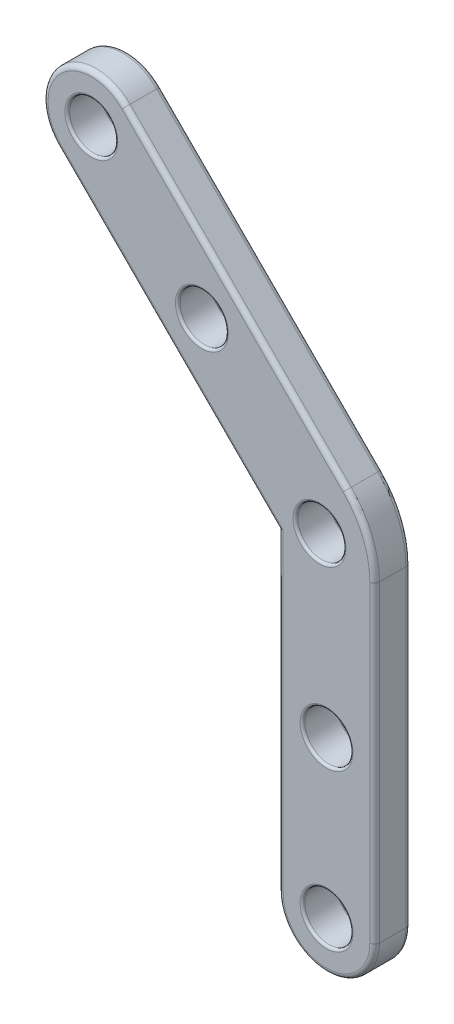
ISO-10303-21;
HEADER;
FILE_DESCRIPTION(('STEP AP214'),'2;1');
FILE_NAME('part.step','',(''),(''),'','','');
FILE_SCHEMA(('AUTOMOTIVE_DESIGN { 1 0 10303 214 1 1 1 1 }'));
ENDSEC;
DATA;
#1=APPLICATION_CONTEXT('core data for automotive mechanical design processes');
#2=APPLICATION_PROTOCOL_DEFINITION('international standard','automotive_design',2000,#1);
#3=PRODUCT_CONTEXT('',#1,'mechanical');
#4=PRODUCT('Part','Part','',(#3));
#5=PRODUCT_RELATED_PRODUCT_CATEGORY('part','',(#4));
#6=PRODUCT_DEFINITION_FORMATION('','',#4);
#7=PRODUCT_DEFINITION_CONTEXT('part definition',#1,'design');
#8=PRODUCT_DEFINITION('design','',#6,#7);
#9=PRODUCT_DEFINITION_SHAPE('','',#8);
#10=(LENGTH_UNIT() NAMED_UNIT(*) SI_UNIT(.MILLI.,.METRE.));
#11=(NAMED_UNIT(*) PLANE_ANGLE_UNIT() SI_UNIT($,.RADIAN.));
#12=(NAMED_UNIT(*) SI_UNIT($,.STERADIAN.) SOLID_ANGLE_UNIT());
#13=UNCERTAINTY_MEASURE_WITH_UNIT(LENGTH_MEASURE(1.E-05),#10,'distance_accuracy_value','');
#14=(GEOMETRIC_REPRESENTATION_CONTEXT(3) GLOBAL_UNCERTAINTY_ASSIGNED_CONTEXT((#13)) GLOBAL_UNIT_ASSIGNED_CONTEXT((#10,
#11,#12)) REPRESENTATION_CONTEXT('',''));
#15=CARTESIAN_POINT('',(0.,0.,0.));
#16=DIRECTION('',(0.,0.,1.));
#17=DIRECTION('',(1.,0.,0.));
#18=AXIS2_PLACEMENT_3D('',#15,#16,#17);
#19=CARTESIAN_POINT('',(-54.4258863696831,179.931852510646,15.));
#20=DIRECTION('',(0.,0.,-1.));
#21=DIRECTION('',(-1.,0.,0.));
#22=AXIS2_PLACEMENT_3D('',#19,#20,#21);
#23=CYLINDRICAL_SURFACE('',#22,20.);
#24=DIRECTION('',(0.,0.,-1.));
#25=VECTOR('',#24,1.);
#26=CARTESIAN_POINT('',(-68.568021993414,165.789716886915,15.));
#27=LINE('',#26,#25);
#28=CARTESIAN_POINT('',(-68.568021993414,165.789716886915,13.));
#29=VERTEX_POINT('',#28);
#30=CARTESIAN_POINT('',(-68.568021993414,165.789716886915,2.));
#31=VERTEX_POINT('',#30);
#32=EDGE_CURVE('E276',#29,#31,#27,.T.);
#33=ORIENTED_EDGE('',*,*,#32,.F.);
#34=CARTESIAN_POINT('',(-54.4258863696831,179.931852510646,13.));
#35=DIRECTION('',(0.,0.,1.));
#36=DIRECTION('',(1.,0.,0.));
#37=AXIS2_PLACEMENT_3D('',#34,#35,#36);
#38=CIRCLE('',#37,20.);
#39=CARTESIAN_POINT('',(-40.2837507459521,194.073988134377,13.));
#40=VERTEX_POINT('',#39);
#41=EDGE_CURVE('E11',#29,#40,#38,.F.);
#42=ORIENTED_EDGE('',*,*,#41,.T.);
#43=DIRECTION('',(0.,0.,-1.));
#44=VECTOR('',#43,1.);
#45=CARTESIAN_POINT('',(-40.2837507459521,194.073988134377,15.));
#46=LINE('',#45,#44);
#47=CARTESIAN_POINT('',(-40.2837507459521,194.073988134377,2.));
#48=VERTEX_POINT('',#47);
#49=EDGE_CURVE('E223',#40,#48,#46,.T.);
#50=ORIENTED_EDGE('',*,*,#49,.T.);
#51=CARTESIAN_POINT('',(-54.4258863696831,179.931852510646,2.));
#52=DIRECTION('',(0.,0.,1.));
#53=DIRECTION('',(1.,0.,0.));
#54=AXIS2_PLACEMENT_3D('',#51,#52,#53);
#55=CIRCLE('',#54,20.);
#56=EDGE_CURVE('E44',#48,#31,#55,.T.);
#57=ORIENTED_EDGE('',*,*,#56,.T.);
#58=EDGE_LOOP('',(#33,#42,#50,#57));
#59=FACE_BOUND('',#58,.T.);
#60=ADVANCED_FACE('F35',(#59),#23,.T.);
#61=CARTESIAN_POINT('',(142.953071662512,-45.7313767690108,15.));
#62=DIRECTION('',(-0.707106781186547,-0.707106781186548,0.));
#63=DIRECTION('',(0.707106781186548,-0.707106781186547,0.));
#64=AXIS2_PLACEMENT_3D('',#61,#62,#63);
#65=PLANE('',#64);
#66=DIRECTION('',(0.,0.,-1.));
#67=VECTOR('',#66,1.);
#68=CARTESIAN_POINT('',(23.3558595608372,73.865835332664,15.));
#69=LINE('',#68,#67);
#70=CARTESIAN_POINT('',(23.3558595608372,73.865835332664,13.));
#71=VERTEX_POINT('',#70);
#72=CARTESIAN_POINT('',(23.3558595608372,73.865835332664,2.));
#73=VERTEX_POINT('',#72);
#74=EDGE_CURVE('E268',#71,#73,#69,.T.);
#75=ORIENTED_EDGE('',*,*,#74,.F.);
#76=DIRECTION('',(-0.707106781186548,0.707106781186547,0.));
#77=VECTOR('',#76,1.);
#78=CARTESIAN_POINT('',(142.953071662512,-45.7313767690108,13.));
#79=LINE('',#78,#77);
#80=EDGE_CURVE('E58',#71,#29,#79,.T.);
#81=ORIENTED_EDGE('',*,*,#80,.T.);
#82=ORIENTED_EDGE('',*,*,#32,.T.);
#83=DIRECTION('',(-0.707106781186548,0.707106781186547,0.));
#84=VECTOR('',#83,1.);
#85=CARTESIAN_POINT('',(23.3558595608372,73.865835332664,2.));
#86=LINE('',#85,#84);
#87=EDGE_CURVE('E205',#31,#73,#86,.F.);
#88=ORIENTED_EDGE('',*,*,#87,.T.);
#89=EDGE_LOOP('',(#75,#81,#82,#88));
#90=FACE_BOUND('',#89,.T.);
#91=ADVANCED_FACE('F373',(#90),#65,.T.);
#92=CARTESIAN_POINT('',(23.3558595608372,-176.03531358384,15.));
#93=DIRECTION('',(1.,0.,0.));
#94=DIRECTION('',(0.,1.,0.));
#95=AXIS2_PLACEMENT_3D('',#92,#93,#94);
#96=PLANE('',#95);
#97=DIRECTION('',(0.,0.,-1.));
#98=VECTOR('',#97,1.);
#99=CARTESIAN_POINT('',(23.3558595608372,-56.134164667336,15.));
#100=LINE('',#99,#98);
#101=CARTESIAN_POINT('',(23.3558595608372,-56.134164667336,13.));
#102=VERTEX_POINT('',#101);
#103=CARTESIAN_POINT('',(23.3558595608372,-56.134164667336,2.));
#104=VERTEX_POINT('',#103);
#105=EDGE_CURVE('E260',#102,#104,#100,.T.);
#106=ORIENTED_EDGE('',*,*,#105,.F.);
#107=DIRECTION('',(0.,-1.,0.));
#108=VECTOR('',#107,1.);
#109=CARTESIAN_POINT('',(23.3558595608372,73.865835332664,13.));
#110=LINE('',#109,#108);
#111=EDGE_CURVE('E203',#102,#71,#110,.F.);
#112=ORIENTED_EDGE('',*,*,#111,.T.);
#113=ORIENTED_EDGE('',*,*,#74,.T.);
#114=DIRECTION('',(0.,-1.,0.));
#115=VECTOR('',#114,1.);
#116=CARTESIAN_POINT('',(23.3558595608372,-176.03531358384,2.));
#117=LINE('',#116,#115);
#118=EDGE_CURVE('E201',#73,#104,#117,.T.);
#119=ORIENTED_EDGE('',*,*,#118,.T.);
#120=EDGE_LOOP('',(#106,#112,#113,#119));
#121=FACE_BOUND('',#120,.T.);
#122=ADVANCED_FACE('F372',(#121),#96,.F.);
#123=CARTESIAN_POINT('',(43.3558595608372,-56.134164667336,15.));
#124=DIRECTION('',(0.,0.,-1.));
#125=DIRECTION('',(-1.,0.,0.));
#126=AXIS2_PLACEMENT_3D('',#123,#124,#125);
#127=CYLINDRICAL_SURFACE('',#126,20.);
#128=DIRECTION('',(0.,0.,-1.));
#129=VECTOR('',#128,1.);
#130=CARTESIAN_POINT('',(63.3558595608372,-56.134164667336,15.));
#131=LINE('',#130,#129);
#132=CARTESIAN_POINT('',(63.3558595608372,-56.134164667336,13.));
#133=VERTEX_POINT('',#132);
#134=CARTESIAN_POINT('',(63.3558595608372,-56.134164667336,2.));
#135=VERTEX_POINT('',#134);
#136=EDGE_CURVE('E257',#133,#135,#131,.T.);
#137=ORIENTED_EDGE('',*,*,#136,.F.);
#138=CARTESIAN_POINT('',(43.3558595608372,-56.134164667336,13.));
#139=DIRECTION('',(0.,0.,1.));
#140=DIRECTION('',(1.,0.,0.));
#141=AXIS2_PLACEMENT_3D('',#138,#139,#140);
#142=CIRCLE('',#141,20.);
#143=EDGE_CURVE('E199',#133,#102,#142,.F.);
#144=ORIENTED_EDGE('',*,*,#143,.T.);
#145=ORIENTED_EDGE('',*,*,#105,.T.);
#146=CARTESIAN_POINT('',(43.3558595608372,-56.134164667336,2.));
#147=DIRECTION('',(0.,0.,1.));
#148=DIRECTION('',(1.,0.,0.));
#149=AXIS2_PLACEMENT_3D('',#146,#147,#148);
#150=CIRCLE('',#149,20.);
#151=EDGE_CURVE('E197',#104,#135,#150,.T.);
#152=ORIENTED_EDGE('',*,*,#151,.T.);
#153=EDGE_LOOP('',(#137,#144,#145,#152));
#154=FACE_BOUND('',#153,.T.);
#155=ADVANCED_FACE('F256',(#154),#127,.T.);
#156=CARTESIAN_POINT('',(63.3558595608372,-176.03531358384,15.));
#157=DIRECTION('',(1.,0.,0.));
#158=DIRECTION('',(0.,1.,0.));
#159=AXIS2_PLACEMENT_3D('',#156,#157,#158);
#160=PLANE('',#159);
#161=DIRECTION('',(0.,0.,-1.));
#162=VECTOR('',#161,1.);
#163=CARTESIAN_POINT('',(63.3558595608372,73.865835332664,15.));
#164=LINE('',#163,#162);
#165=CARTESIAN_POINT('',(63.3558595608372,73.865835332664,13.));
#166=VERTEX_POINT('',#165);
#167=CARTESIAN_POINT('',(63.3558595608372,73.865835332664,2.));
#168=VERTEX_POINT('',#167);
#169=EDGE_CURVE('E266',#166,#168,#164,.T.);
#170=ORIENTED_EDGE('',*,*,#169,.F.);
#171=DIRECTION('',(0.,-1.,0.));
#172=VECTOR('',#171,1.);
#173=CARTESIAN_POINT('',(63.3558595608372,-176.03531358384,13.));
#174=LINE('',#173,#172);
#175=EDGE_CURVE('E195',#166,#133,#174,.T.);
#176=ORIENTED_EDGE('',*,*,#175,.T.);
#177=ORIENTED_EDGE('',*,*,#136,.T.);
#178=DIRECTION('',(0.,-1.,0.));
#179=VECTOR('',#178,1.);
#180=CARTESIAN_POINT('',(63.3558595608372,73.865835332664,2.));
#181=LINE('',#180,#179);
#182=EDGE_CURVE('E193',#135,#168,#181,.F.);
#183=ORIENTED_EDGE('',*,*,#182,.T.);
#184=EDGE_LOOP('',(#170,#176,#177,#183));
#185=FACE_BOUND('',#184,.T.);
#186=ADVANCED_FACE('F263',(#185),#160,.T.);
#187=CARTESIAN_POINT('',(23.3558595608372,73.865835332664,15.));
#188=DIRECTION('',(0.,0.,-1.));
#189=DIRECTION('',(-1.,0.,0.));
#190=AXIS2_PLACEMENT_3D('',#187,#188,#189);
#191=CYLINDRICAL_SURFACE('',#190,40.);
#192=DIRECTION('',(0.,0.,-1.));
#193=VECTOR('',#192,1.);
#194=CARTESIAN_POINT('',(51.6401308082991,102.150106580126,15.));
#195=LINE('',#194,#193);
#196=CARTESIAN_POINT('',(51.6401308082991,102.150106580126,13.));
#197=VERTEX_POINT('',#196);
#198=CARTESIAN_POINT('',(51.6401308082991,102.150106580126,2.));
#199=VERTEX_POINT('',#198);
#200=EDGE_CURVE('E270',#197,#199,#195,.T.);
#201=ORIENTED_EDGE('',*,*,#200,.F.);
#202=CARTESIAN_POINT('',(23.3558595608372,73.865835332664,13.));
#203=DIRECTION('',(0.,0.,1.));
#204=DIRECTION('',(1.,0.,0.));
#205=AXIS2_PLACEMENT_3D('',#202,#203,#204);
#206=CIRCLE('',#205,40.);
#207=EDGE_CURVE('E191',#197,#166,#206,.F.);
#208=ORIENTED_EDGE('',*,*,#207,.T.);
#209=ORIENTED_EDGE('',*,*,#169,.T.);
#210=CARTESIAN_POINT('',(23.3558595608372,73.865835332664,2.));
#211=DIRECTION('',(0.,0.,1.));
#212=DIRECTION('',(1.,0.,0.));
#213=AXIS2_PLACEMENT_3D('',#210,#211,#212);
#214=CIRCLE('',#213,40.);
#215=EDGE_CURVE('E189',#168,#199,#214,.T.);
#216=ORIENTED_EDGE('',*,*,#215,.T.);
#217=EDGE_LOOP('',(#201,#208,#209,#216));
#218=FACE_BOUND('',#217,.T.);
#219=ADVANCED_FACE('F357',(#218),#191,.T.);
#220=CARTESIAN_POINT('',(171.237342909974,-17.447105521549,15.));
#221=DIRECTION('',(-0.707106781186547,-0.707106781186547,0.));
#222=DIRECTION('',(0.707106781186548,-0.707106781186548,0.));
#223=AXIS2_PLACEMENT_3D('',#220,#221,#222);
#224=PLANE('',#223);
#225=ORIENTED_EDGE('',*,*,#49,.F.);
#226=DIRECTION('',(-0.707106781186548,0.707106781186548,0.));
#227=VECTOR('',#226,1.);
#228=CARTESIAN_POINT('',(51.6401308082991,102.150106580126,13.));
#229=LINE('',#228,#227);
#230=EDGE_CURVE('E145',#40,#197,#229,.F.);
#231=ORIENTED_EDGE('',*,*,#230,.T.);
#232=ORIENTED_EDGE('',*,*,#200,.T.);
#233=DIRECTION('',(-0.707106781186548,0.707106781186548,0.));
#234=VECTOR('',#233,1.);
#235=CARTESIAN_POINT('',(171.237342909974,-17.447105521549,2.));
#236=LINE('',#235,#234);
#237=EDGE_CURVE('E165',#199,#48,#236,.T.);
#238=ORIENTED_EDGE('',*,*,#237,.T.);
#239=EDGE_LOOP('',(#225,#231,#232,#238));
#240=FACE_BOUND('',#239,.T.);
#241=ADVANCED_FACE('F355',(#240),#224,.F.);
#242=CARTESIAN_POINT('',(12.6491348476825,-176.03531358384,15.));
#243=DIRECTION('',(0.,0.,1.));
#244=DIRECTION('',(1.,0.,0.));
#245=AXIS2_PLACEMENT_3D('',#242,#243,#244);
#246=PLANE('',#245);
#247=CARTESIAN_POINT('',(23.3558595608372,73.865835332664,15.));
#248=DIRECTION('',(0.,0.,1.));
#249=DIRECTION('',(1.,0.,0.));
#250=AXIS2_PLACEMENT_3D('',#247,#248,#249);
#251=CIRCLE('',#250,38.);
#252=CARTESIAN_POINT('',(61.3558595608372,73.865835332664,15.));
#253=VERTEX_POINT('',#252);
#254=CARTESIAN_POINT('',(50.225917245926,100.735893017753,15.));
#255=VERTEX_POINT('',#254);
#256=EDGE_CURVE('E163',#253,#255,#251,.T.);
#257=ORIENTED_EDGE('',*,*,#256,.T.);
#258=DIRECTION('',(-0.707106781186548,0.707106781186548,0.));
#259=VECTOR('',#258,1.);
#260=CARTESIAN_POINT('',(-41.6979643083252,192.659774572004,15.));
#261=LINE('',#260,#259);
#262=CARTESIAN_POINT('',(-41.6979643083252,192.659774572004,15.));
#263=VERTEX_POINT('',#262);
#264=EDGE_CURVE('E143',#255,#263,#261,.T.);
#265=ORIENTED_EDGE('',*,*,#264,.T.);
#266=CARTESIAN_POINT('',(-54.4258863696831,179.931852510646,15.));
#267=DIRECTION('',(0.,0.,1.));
#268=DIRECTION('',(1.,0.,0.));
#269=AXIS2_PLACEMENT_3D('',#266,#267,#268);
#270=CIRCLE('',#269,18.);
#271=CARTESIAN_POINT('',(-67.1538084310409,167.203930449288,15.));
#272=VERTEX_POINT('',#271);
#273=EDGE_CURVE('E151',#263,#272,#270,.T.);
#274=ORIENTED_EDGE('',*,*,#273,.T.);
#275=DIRECTION('',(-0.707106781186548,0.707106781186547,0.));
#276=VECTOR('',#275,1.);
#277=CARTESIAN_POINT('',(144.367285224885,-44.3171632066377,15.));
#278=LINE('',#277,#276);
#279=CARTESIAN_POINT('',(25.3558595608372,74.6942624574101,15.));
#280=VERTEX_POINT('',#279);
#281=EDGE_CURVE('E157',#272,#280,#278,.F.);
#282=ORIENTED_EDGE('',*,*,#281,.T.);
#283=DIRECTION('',(0.,-1.,0.));
#284=VECTOR('',#283,1.);
#285=CARTESIAN_POINT('',(25.3558595608372,-56.134164667336,15.));
#286=LINE('',#285,#284);
#287=CARTESIAN_POINT('',(25.3558595608372,-56.134164667336,15.));
#288=VERTEX_POINT('',#287);
#289=EDGE_CURVE('E338',#280,#288,#286,.T.);
#290=ORIENTED_EDGE('',*,*,#289,.T.);
#291=CARTESIAN_POINT('',(43.3558595608372,-56.134164667336,15.));
#292=DIRECTION('',(0.,0.,1.));
#293=DIRECTION('',(1.,0.,0.));
#294=AXIS2_PLACEMENT_3D('',#291,#292,#293);
#295=CIRCLE('',#294,18.);
#296=CARTESIAN_POINT('',(61.3558595608372,-56.134164667336,15.));
#297=VERTEX_POINT('',#296);
#298=EDGE_CURVE('E340',#288,#297,#295,.T.);
#299=ORIENTED_EDGE('',*,*,#298,.T.);
#300=DIRECTION('',(0.,-1.,0.));
#301=VECTOR('',#300,1.);
#302=CARTESIAN_POINT('',(61.3558595608372,-176.03531358384,15.));
#303=LINE('',#302,#301);
#304=EDGE_CURVE('E169',#297,#253,#303,.F.);
#305=ORIENTED_EDGE('',*,*,#304,.T.);
#306=EDGE_LOOP('',(#257,#265,#274,#282,#290,#299,#305));
#307=FACE_BOUND('',#306,.T.);
#308=CARTESIAN_POINT('',(-54.425886369683,179.931852510646,15.));
#309=DIRECTION('',(0.,0.,1.));
#310=DIRECTION('',(1.,0.,0.));
#311=AXIS2_PLACEMENT_3D('',#308,#309,#310);
#312=CIRCLE('',#311,11.);
#313=CARTESIAN_POINT('',(-43.425886369683,179.931852510646,15.));
#314=VERTEX_POINT('',#313);
#315=EDGE_CURVE('E311',#314,#314,#312,.F.);
#316=ORIENTED_EDGE('',*,*,#315,.T.);
#317=EDGE_LOOP('',(#316));
#318=FACE_BOUND('',#317,.T.);
#319=CARTESIAN_POINT('',(-8.46394559255745,133.96991173352,15.));
#320=DIRECTION('',(0.,0.,1.));
#321=DIRECTION('',(1.,0.,0.));
#322=AXIS2_PLACEMENT_3D('',#319,#320,#321);
#323=CIRCLE('',#322,11.);
#324=CARTESIAN_POINT('',(2.53605440744255,133.96991173352,15.));
#325=VERTEX_POINT('',#324);
#326=EDGE_CURVE('E308',#325,#325,#323,.F.);
#327=ORIENTED_EDGE('',*,*,#326,.T.);
#328=EDGE_LOOP('',(#327));
#329=FACE_BOUND('',#328,.T.);
#330=CARTESIAN_POINT('',(40.4269273727027,80.9369031445294,15.));
#331=DIRECTION('',(0.,0.,1.));
#332=DIRECTION('',(1.,0.,0.));
#333=AXIS2_PLACEMENT_3D('',#330,#331,#332);
#334=CIRCLE('',#333,11.);
#335=CARTESIAN_POINT('',(51.4269273727027,80.9369031445294,15.));
#336=VERTEX_POINT('',#335);
#337=EDGE_CURVE('E305',#336,#336,#334,.F.);
#338=ORIENTED_EDGE('',*,*,#337,.T.);
#339=EDGE_LOOP('',(#338));
#340=FACE_BOUND('',#339,.T.);
#341=CARTESIAN_POINT('',(43.3558595608372,8.86583533266388,15.));
#342=DIRECTION('',(0.,0.,1.));
#343=DIRECTION('',(1.,0.,0.));
#344=AXIS2_PLACEMENT_3D('',#341,#342,#343);
#345=CIRCLE('',#344,11.);
#346=CARTESIAN_POINT('',(54.3558595608372,8.86583533266388,15.));
#347=VERTEX_POINT('',#346);
#348=EDGE_CURVE('E302',#347,#347,#345,.F.);
#349=ORIENTED_EDGE('',*,*,#348,.T.);
#350=EDGE_LOOP('',(#349));
#351=FACE_BOUND('',#350,.T.);
#352=CARTESIAN_POINT('',(43.3558595608372,-56.134164667336,15.));
#353=DIRECTION('',(0.,0.,1.));
#354=DIRECTION('',(1.,0.,0.));
#355=AXIS2_PLACEMENT_3D('',#352,#353,#354);
#356=CIRCLE('',#355,11.);
#357=CARTESIAN_POINT('',(54.3558595608372,-56.134164667336,15.));
#358=VERTEX_POINT('',#357);
#359=EDGE_CURVE('E299',#358,#358,#356,.F.);
#360=ORIENTED_EDGE('',*,*,#359,.T.);
#361=EDGE_LOOP('',(#360));
#362=FACE_BOUND('',#361,.T.);
#363=ADVANCED_FACE('F160',(#307,#318,#329,#340,#351,#362),#246,.T.);
#364=CARTESIAN_POINT('',(12.6491348476825,-176.03531358384,0.));
#365=DIRECTION('',(0.,0.,1.));
#366=DIRECTION('',(1.,0.,0.));
#367=AXIS2_PLACEMENT_3D('',#364,#365,#366);
#368=PLANE('',#367);
#369=CARTESIAN_POINT('',(-54.4258863696831,179.931852510646,0.));
#370=DIRECTION('',(0.,0.,1.));
#371=DIRECTION('',(1.,0.,0.));
#372=AXIS2_PLACEMENT_3D('',#369,#370,#371);
#373=CIRCLE('',#372,18.);
#374=CARTESIAN_POINT('',(-67.1538084310409,167.203930449288,0.));
#375=VERTEX_POINT('',#374);
#376=CARTESIAN_POINT('',(-41.6979643083252,192.659774572004,0.));
#377=VERTEX_POINT('',#376);
#378=EDGE_CURVE('E174',#375,#377,#373,.F.);
#379=ORIENTED_EDGE('',*,*,#378,.T.);
#380=DIRECTION('',(-0.707106781186548,0.707106781186548,0.));
#381=VECTOR('',#380,1.);
#382=CARTESIAN_POINT('',(169.823129347601,-18.8613190839221,0.));
#383=LINE('',#382,#381);
#384=CARTESIAN_POINT('',(50.225917245926,100.735893017753,0.));
#385=VERTEX_POINT('',#384);
#386=EDGE_CURVE('E186',#377,#385,#383,.F.);
#387=ORIENTED_EDGE('',*,*,#386,.T.);
#388=CARTESIAN_POINT('',(23.3558595608372,73.865835332664,0.));
#389=DIRECTION('',(0.,0.,1.));
#390=DIRECTION('',(1.,0.,0.));
#391=AXIS2_PLACEMENT_3D('',#388,#389,#390);
#392=CIRCLE('',#391,38.);
#393=CARTESIAN_POINT('',(61.3558595608372,73.865835332664,0.));
#394=VERTEX_POINT('',#393);
#395=EDGE_CURVE('E184',#385,#394,#392,.F.);
#396=ORIENTED_EDGE('',*,*,#395,.T.);
#397=DIRECTION('',(0.,-1.,0.));
#398=VECTOR('',#397,1.);
#399=CARTESIAN_POINT('',(61.3558595608372,-56.134164667336,0.));
#400=LINE('',#399,#398);
#401=CARTESIAN_POINT('',(61.3558595608372,-56.134164667336,0.));
#402=VERTEX_POINT('',#401);
#403=EDGE_CURVE('E182',#394,#402,#400,.T.);
#404=ORIENTED_EDGE('',*,*,#403,.T.);
#405=CARTESIAN_POINT('',(43.3558595608372,-56.134164667336,0.));
#406=DIRECTION('',(0.,0.,1.));
#407=DIRECTION('',(1.,0.,0.));
#408=AXIS2_PLACEMENT_3D('',#405,#406,#407);
#409=CIRCLE('',#408,18.);
#410=CARTESIAN_POINT('',(25.3558595608372,-56.134164667336,0.));
#411=VERTEX_POINT('',#410);
#412=EDGE_CURVE('E180',#402,#411,#409,.F.);
#413=ORIENTED_EDGE('',*,*,#412,.T.);
#414=DIRECTION('',(0.,-1.,0.));
#415=VECTOR('',#414,1.);
#416=CARTESIAN_POINT('',(25.3558595608372,-176.03531358384,0.));
#417=LINE('',#416,#415);
#418=CARTESIAN_POINT('',(25.3558595608372,74.6942624574101,0.));
#419=VERTEX_POINT('',#418);
#420=EDGE_CURVE('E178',#411,#419,#417,.F.);
#421=ORIENTED_EDGE('',*,*,#420,.T.);
#422=DIRECTION('',(-0.707106781186548,0.707106781186547,0.));
#423=VECTOR('',#422,1.);
#424=CARTESIAN_POINT('',(-67.1538084310409,167.203930449288,0.));
#425=LINE('',#424,#423);
#426=EDGE_CURVE('E176',#419,#375,#425,.T.);
#427=ORIENTED_EDGE('',*,*,#426,.T.);
#428=EDGE_LOOP('',(#379,#387,#396,#404,#413,#421,#427));
#429=FACE_BOUND('',#428,.T.);
#430=CARTESIAN_POINT('',(-54.425886369683,179.931852510646,0.));
#431=DIRECTION('',(0.,0.,1.));
#432=DIRECTION('',(1.,0.,0.));
#433=AXIS2_PLACEMENT_3D('',#430,#431,#432);
#434=CIRCLE('',#433,11.);
#435=CARTESIAN_POINT('',(-43.425886369683,179.931852510646,0.));
#436=VERTEX_POINT('',#435);
#437=EDGE_CURVE('E296',#436,#436,#434,.T.);
#438=ORIENTED_EDGE('',*,*,#437,.T.);
#439=EDGE_LOOP('',(#438));
#440=FACE_BOUND('',#439,.T.);
#441=CARTESIAN_POINT('',(-8.46394559255745,133.96991173352,0.));
#442=DIRECTION('',(0.,0.,1.));
#443=DIRECTION('',(1.,0.,0.));
#444=AXIS2_PLACEMENT_3D('',#441,#442,#443);
#445=CIRCLE('',#444,11.);
#446=CARTESIAN_POINT('',(2.53605440744255,133.96991173352,0.));
#447=VERTEX_POINT('',#446);
#448=EDGE_CURVE('E293',#447,#447,#445,.T.);
#449=ORIENTED_EDGE('',*,*,#448,.T.);
#450=EDGE_LOOP('',(#449));
#451=FACE_BOUND('',#450,.T.);
#452=CARTESIAN_POINT('',(40.4269273727027,80.9369031445294,0.));
#453=DIRECTION('',(0.,0.,1.));
#454=DIRECTION('',(1.,0.,0.));
#455=AXIS2_PLACEMENT_3D('',#452,#453,#454);
#456=CIRCLE('',#455,11.);
#457=CARTESIAN_POINT('',(51.4269273727027,80.9369031445294,0.));
#458=VERTEX_POINT('',#457);
#459=EDGE_CURVE('E290',#458,#458,#456,.T.);
#460=ORIENTED_EDGE('',*,*,#459,.T.);
#461=EDGE_LOOP('',(#460));
#462=FACE_BOUND('',#461,.T.);
#463=CARTESIAN_POINT('',(43.3558595608372,8.86583533266388,0.));
#464=DIRECTION('',(0.,0.,1.));
#465=DIRECTION('',(1.,0.,0.));
#466=AXIS2_PLACEMENT_3D('',#463,#464,#465);
#467=CIRCLE('',#466,11.);
#468=CARTESIAN_POINT('',(54.3558595608372,8.86583533266388,0.));
#469=VERTEX_POINT('',#468);
#470=EDGE_CURVE('E287',#469,#469,#467,.T.);
#471=ORIENTED_EDGE('',*,*,#470,.T.);
#472=EDGE_LOOP('',(#471));
#473=FACE_BOUND('',#472,.T.);
#474=CARTESIAN_POINT('',(43.3558595608372,-56.134164667336,0.));
#475=DIRECTION('',(0.,0.,1.));
#476=DIRECTION('',(1.,0.,0.));
#477=AXIS2_PLACEMENT_3D('',#474,#475,#476);
#478=CIRCLE('',#477,11.);
#479=CARTESIAN_POINT('',(54.3558595608372,-56.134164667336,0.));
#480=VERTEX_POINT('',#479);
#481=EDGE_CURVE('E284',#480,#480,#478,.T.);
#482=ORIENTED_EDGE('',*,*,#481,.T.);
#483=EDGE_LOOP('',(#482));
#484=FACE_BOUND('',#483,.T.);
#485=ADVANCED_FACE('F384',(#429,#440,#451,#462,#473,#484),#368,.F.);
#486=CARTESIAN_POINT('',(-54.425886369683,179.931852510646,15.));
#487=DIRECTION('',(0.,0.,-1.));
#488=DIRECTION('',(-1.,0.,0.));
#489=AXIS2_PLACEMENT_3D('',#486,#487,#488);
#490=CYLINDRICAL_SURFACE('',#489,9.99999999999999);
#491=CARTESIAN_POINT('',(-54.425886369683,179.931852510646,1.));
#492=DIRECTION('',(0.,0.,1.));
#493=DIRECTION('',(1.,0.,0.));
#494=AXIS2_PLACEMENT_3D('',#491,#492,#493);
#495=CIRCLE('',#494,9.99999999999999);
#496=CARTESIAN_POINT('',(-44.425886369683,179.931852510646,1.));
#497=VERTEX_POINT('',#496);
#498=EDGE_CURVE('E281',#497,#497,#495,.F.);
#499=ORIENTED_EDGE('',*,*,#498,.T.);
#500=EDGE_LOOP('',(#499));
#501=FACE_BOUND('',#500,.T.);
#502=CARTESIAN_POINT('',(-54.425886369683,179.931852510646,14.));
#503=DIRECTION('',(0.,0.,1.));
#504=DIRECTION('',(1.,0.,0.));
#505=AXIS2_PLACEMENT_3D('',#502,#503,#504);
#506=CIRCLE('',#505,9.99999999999999);
#507=CARTESIAN_POINT('',(-44.425886369683,179.931852510646,14.));
#508=VERTEX_POINT('',#507);
#509=EDGE_CURVE('E278',#508,#508,#506,.T.);
#510=ORIENTED_EDGE('',*,*,#509,.T.);
#511=EDGE_LOOP('',(#510));
#512=FACE_BOUND('',#511,.T.);
#513=ADVANCED_FACE('F627',(#501,#512),#490,.F.);
#514=CARTESIAN_POINT('',(-8.46394559255745,133.96991173352,15.));
#515=DIRECTION('',(0.,0.,-1.));
#516=DIRECTION('',(-1.,0.,0.));
#517=AXIS2_PLACEMENT_3D('',#514,#515,#516);
#518=CYLINDRICAL_SURFACE('',#517,10.);
#519=CARTESIAN_POINT('',(-8.46394559255745,133.96991173352,1.));
#520=DIRECTION('',(0.,0.,1.));
#521=DIRECTION('',(1.,0.,0.));
#522=AXIS2_PLACEMENT_3D('',#519,#520,#521);
#523=CIRCLE('',#522,10.);
#524=CARTESIAN_POINT('',(1.53605440744256,133.96991173352,1.));
#525=VERTEX_POINT('',#524);
#526=EDGE_CURVE('E317',#525,#525,#523,.F.);
#527=ORIENTED_EDGE('',*,*,#526,.T.);
#528=EDGE_LOOP('',(#527));
#529=FACE_BOUND('',#528,.T.);
#530=CARTESIAN_POINT('',(-8.46394559255745,133.96991173352,14.));
#531=DIRECTION('',(0.,0.,1.));
#532=DIRECTION('',(1.,0.,0.));
#533=AXIS2_PLACEMENT_3D('',#530,#531,#532);
#534=CIRCLE('',#533,10.);
#535=CARTESIAN_POINT('',(1.53605440744256,133.96991173352,14.));
#536=VERTEX_POINT('',#535);
#537=EDGE_CURVE('E314',#536,#536,#534,.T.);
#538=ORIENTED_EDGE('',*,*,#537,.T.);
#539=EDGE_LOOP('',(#538));
#540=FACE_BOUND('',#539,.T.);
#541=ADVANCED_FACE('F618',(#529,#540),#518,.F.);
#542=CARTESIAN_POINT('',(40.4269273727027,80.9369031445294,15.));
#543=DIRECTION('',(0.,0.,-1.));
#544=DIRECTION('',(-1.,0.,0.));
#545=AXIS2_PLACEMENT_3D('',#542,#543,#544);
#546=CYLINDRICAL_SURFACE('',#545,10.);
#547=CARTESIAN_POINT('',(40.4269273727027,80.9369031445294,14.));
#548=DIRECTION('',(0.,0.,1.));
#549=DIRECTION('',(1.,0.,0.));
#550=AXIS2_PLACEMENT_3D('',#547,#548,#549);
#551=CIRCLE('',#550,10.);
#552=CARTESIAN_POINT('',(50.4269273727027,80.9369031445294,14.));
#553=VERTEX_POINT('',#552);
#554=EDGE_CURVE('E323',#553,#553,#551,.T.);
#555=ORIENTED_EDGE('',*,*,#554,.T.);
#556=EDGE_LOOP('',(#555));
#557=FACE_BOUND('',#556,.T.);
#558=CARTESIAN_POINT('',(40.4269273727027,80.9369031445294,1.));
#559=DIRECTION('',(0.,0.,1.));
#560=DIRECTION('',(1.,0.,0.));
#561=AXIS2_PLACEMENT_3D('',#558,#559,#560);
#562=CIRCLE('',#561,10.);
#563=CARTESIAN_POINT('',(50.4269273727027,80.9369031445294,1.));
#564=VERTEX_POINT('',#563);
#565=EDGE_CURVE('E320',#564,#564,#562,.F.);
#566=ORIENTED_EDGE('',*,*,#565,.T.);
#567=EDGE_LOOP('',(#566));
#568=FACE_BOUND('',#567,.T.);
#569=ADVANCED_FACE('F609',(#557,#568),#546,.F.);
#570=CARTESIAN_POINT('',(43.3558595608372,8.86583533266388,15.));
#571=DIRECTION('',(0.,0.,-1.));
#572=DIRECTION('',(-1.,0.,0.));
#573=AXIS2_PLACEMENT_3D('',#570,#571,#572);
#574=CYLINDRICAL_SURFACE('',#573,10.);
#575=CARTESIAN_POINT('',(43.3558595608372,8.86583533266388,14.));
#576=DIRECTION('',(0.,0.,1.));
#577=DIRECTION('',(1.,0.,0.));
#578=AXIS2_PLACEMENT_3D('',#575,#576,#577);
#579=CIRCLE('',#578,10.);
#580=CARTESIAN_POINT('',(53.3558595608372,8.86583533266388,14.));
#581=VERTEX_POINT('',#580);
#582=EDGE_CURVE('E329',#581,#581,#579,.T.);
#583=ORIENTED_EDGE('',*,*,#582,.T.);
#584=EDGE_LOOP('',(#583));
#585=FACE_BOUND('',#584,.T.);
#586=CARTESIAN_POINT('',(43.3558595608372,8.86583533266388,1.));
#587=DIRECTION('',(0.,0.,1.));
#588=DIRECTION('',(1.,0.,0.));
#589=AXIS2_PLACEMENT_3D('',#586,#587,#588);
#590=CIRCLE('',#589,10.);
#591=CARTESIAN_POINT('',(53.3558595608372,8.86583533266388,1.));
#592=VERTEX_POINT('',#591);
#593=EDGE_CURVE('E326',#592,#592,#590,.F.);
#594=ORIENTED_EDGE('',*,*,#593,.T.);
#595=EDGE_LOOP('',(#594));
#596=FACE_BOUND('',#595,.T.);
#597=ADVANCED_FACE('F600',(#585,#596),#574,.F.);
#598=CARTESIAN_POINT('',(43.3558595608372,-56.134164667336,15.));
#599=DIRECTION('',(0.,0.,-1.));
#600=DIRECTION('',(-1.,0.,0.));
#601=AXIS2_PLACEMENT_3D('',#598,#599,#600);
#602=CYLINDRICAL_SURFACE('',#601,10.);
#603=CARTESIAN_POINT('',(43.3558595608372,-56.134164667336,14.));
#604=DIRECTION('',(0.,0.,1.));
#605=DIRECTION('',(1.,0.,0.));
#606=AXIS2_PLACEMENT_3D('',#603,#604,#605);
#607=CIRCLE('',#606,10.);
#608=CARTESIAN_POINT('',(53.3558595608372,-56.134164667336,14.));
#609=VERTEX_POINT('',#608);
#610=EDGE_CURVE('E158',#609,#609,#607,.T.);
#611=ORIENTED_EDGE('',*,*,#610,.T.);
#612=EDGE_LOOP('',(#611));
#613=FACE_BOUND('',#612,.T.);
#614=CARTESIAN_POINT('',(43.3558595608372,-56.134164667336,1.));
#615=DIRECTION('',(0.,0.,1.));
#616=DIRECTION('',(1.,0.,0.));
#617=AXIS2_PLACEMENT_3D('',#614,#615,#616);
#618=CIRCLE('',#617,10.);
#619=CARTESIAN_POINT('',(53.3558595608372,-56.134164667336,1.));
#620=VERTEX_POINT('',#619);
#621=EDGE_CURVE('E332',#620,#620,#618,.F.);
#622=ORIENTED_EDGE('',*,*,#621,.T.);
#623=EDGE_LOOP('',(#622));
#624=FACE_BOUND('',#623,.T.);
#625=ADVANCED_FACE('F413',(#613,#624),#602,.F.);
#626=CARTESIAN_POINT('',(-54.425886369683,179.931852510646,1.));
#627=DIRECTION('',(0.,0.,1.));
#628=DIRECTION('',(1.,0.,0.));
#629=AXIS2_PLACEMENT_3D('',#626,#627,#628);
#630=TOROIDAL_SURFACE('',#629,11.,1.);
#631=ORIENTED_EDGE('',*,*,#437,.F.);
#632=EDGE_LOOP('',(#631));
#633=FACE_BOUND('',#632,.T.);
#634=ORIENTED_EDGE('',*,*,#498,.F.);
#635=EDGE_LOOP('',(#634));
#636=FACE_BOUND('',#635,.T.);
#637=ADVANCED_FACE('F409',(#633,#636),#630,.T.);
#638=CARTESIAN_POINT('',(-54.425886369683,179.931852510646,14.));
#639=DIRECTION('',(0.,0.,1.));
#640=DIRECTION('',(1.,0.,0.));
#641=AXIS2_PLACEMENT_3D('',#638,#639,#640);
#642=TOROIDAL_SURFACE('',#641,11.,1.);
#643=ORIENTED_EDGE('',*,*,#509,.F.);
#644=EDGE_LOOP('',(#643));
#645=FACE_BOUND('',#644,.T.);
#646=ORIENTED_EDGE('',*,*,#315,.F.);
#647=EDGE_LOOP('',(#646));
#648=FACE_BOUND('',#647,.T.);
#649=ADVANCED_FACE('F412',(#645,#648),#642,.T.);
#650=CARTESIAN_POINT('',(-8.46394559255745,133.96991173352,1.));
#651=DIRECTION('',(0.,0.,1.));
#652=DIRECTION('',(1.,0.,0.));
#653=AXIS2_PLACEMENT_3D('',#650,#651,#652);
#654=TOROIDAL_SURFACE('',#653,11.,1.);
#655=ORIENTED_EDGE('',*,*,#448,.F.);
#656=EDGE_LOOP('',(#655));
#657=FACE_BOUND('',#656,.T.);
#658=ORIENTED_EDGE('',*,*,#526,.F.);
#659=EDGE_LOOP('',(#658));
#660=FACE_BOUND('',#659,.T.);
#661=ADVANCED_FACE('F417',(#657,#660),#654,.T.);
#662=CARTESIAN_POINT('',(-8.46394559255745,133.96991173352,14.));
#663=DIRECTION('',(0.,0.,1.));
#664=DIRECTION('',(1.,0.,0.));
#665=AXIS2_PLACEMENT_3D('',#662,#663,#664);
#666=TOROIDAL_SURFACE('',#665,11.,1.);
#667=ORIENTED_EDGE('',*,*,#537,.F.);
#668=EDGE_LOOP('',(#667));
#669=FACE_BOUND('',#668,.T.);
#670=ORIENTED_EDGE('',*,*,#326,.F.);
#671=EDGE_LOOP('',(#670));
#672=FACE_BOUND('',#671,.T.);
#673=ADVANCED_FACE('F421',(#669,#672),#666,.T.);
#674=CARTESIAN_POINT('',(40.4269273727027,80.9369031445294,14.));
#675=DIRECTION('',(0.,0.,1.));
#676=DIRECTION('',(1.,0.,0.));
#677=AXIS2_PLACEMENT_3D('',#674,#675,#676);
#678=TOROIDAL_SURFACE('',#677,11.,1.);
#679=ORIENTED_EDGE('',*,*,#554,.F.);
#680=EDGE_LOOP('',(#679));
#681=FACE_BOUND('',#680,.T.);
#682=ORIENTED_EDGE('',*,*,#337,.F.);
#683=EDGE_LOOP('',(#682));
#684=FACE_BOUND('',#683,.T.);
#685=ADVANCED_FACE('F425',(#681,#684),#678,.T.);
#686=CARTESIAN_POINT('',(40.4269273727027,80.9369031445294,1.));
#687=DIRECTION('',(0.,0.,1.));
#688=DIRECTION('',(1.,0.,0.));
#689=AXIS2_PLACEMENT_3D('',#686,#687,#688);
#690=TOROIDAL_SURFACE('',#689,11.,1.);
#691=ORIENTED_EDGE('',*,*,#459,.F.);
#692=EDGE_LOOP('',(#691));
#693=FACE_BOUND('',#692,.T.);
#694=ORIENTED_EDGE('',*,*,#565,.F.);
#695=EDGE_LOOP('',(#694));
#696=FACE_BOUND('',#695,.T.);
#697=ADVANCED_FACE('F429',(#693,#696),#690,.T.);
#698=CARTESIAN_POINT('',(43.3558595608372,8.86583533266388,14.));
#699=DIRECTION('',(0.,0.,1.));
#700=DIRECTION('',(1.,0.,0.));
#701=AXIS2_PLACEMENT_3D('',#698,#699,#700);
#702=TOROIDAL_SURFACE('',#701,11.,1.);
#703=ORIENTED_EDGE('',*,*,#582,.F.);
#704=EDGE_LOOP('',(#703));
#705=FACE_BOUND('',#704,.T.);
#706=ORIENTED_EDGE('',*,*,#348,.F.);
#707=EDGE_LOOP('',(#706));
#708=FACE_BOUND('',#707,.T.);
#709=ADVANCED_FACE('F433',(#705,#708),#702,.T.);
#710=CARTESIAN_POINT('',(43.3558595608372,8.86583533266388,1.));
#711=DIRECTION('',(0.,0.,1.));
#712=DIRECTION('',(1.,0.,0.));
#713=AXIS2_PLACEMENT_3D('',#710,#711,#712);
#714=TOROIDAL_SURFACE('',#713,11.,1.);
#715=ORIENTED_EDGE('',*,*,#470,.F.);
#716=EDGE_LOOP('',(#715));
#717=FACE_BOUND('',#716,.T.);
#718=ORIENTED_EDGE('',*,*,#593,.F.);
#719=EDGE_LOOP('',(#718));
#720=FACE_BOUND('',#719,.T.);
#721=ADVANCED_FACE('F437',(#717,#720),#714,.T.);
#722=CARTESIAN_POINT('',(43.3558595608372,-56.134164667336,14.));
#723=DIRECTION('',(0.,0.,1.));
#724=DIRECTION('',(1.,0.,0.));
#725=AXIS2_PLACEMENT_3D('',#722,#723,#724);
#726=TOROIDAL_SURFACE('',#725,11.,1.);
#727=ORIENTED_EDGE('',*,*,#610,.F.);
#728=EDGE_LOOP('',(#727));
#729=FACE_BOUND('',#728,.T.);
#730=ORIENTED_EDGE('',*,*,#359,.F.);
#731=EDGE_LOOP('',(#730));
#732=FACE_BOUND('',#731,.T.);
#733=ADVANCED_FACE('F441',(#729,#732),#726,.T.);
#734=CARTESIAN_POINT('',(43.3558595608372,-56.134164667336,1.));
#735=DIRECTION('',(0.,0.,1.));
#736=DIRECTION('',(1.,0.,0.));
#737=AXIS2_PLACEMENT_3D('',#734,#735,#736);
#738=TOROIDAL_SURFACE('',#737,11.,1.);
#739=ORIENTED_EDGE('',*,*,#481,.F.);
#740=EDGE_LOOP('',(#739));
#741=FACE_BOUND('',#740,.T.);
#742=ORIENTED_EDGE('',*,*,#621,.F.);
#743=EDGE_LOOP('',(#742));
#744=FACE_BOUND('',#743,.T.);
#745=ADVANCED_FACE('F445',(#741,#744),#738,.T.);
#746=CARTESIAN_POINT('',(43.3558595608372,-56.134164667336,13.));
#747=DIRECTION('',(0.,0.,1.));
#748=DIRECTION('',(1.,0.,0.));
#749=AXIS2_PLACEMENT_3D('',#746,#747,#748);
#750=TOROIDAL_SURFACE('',#749,18.,2.);
#751=CARTESIAN_POINT('',(61.3558595608372,-56.134164667336,13.));
#752=DIRECTION('',(0.,1.,0.));
#753=DIRECTION('',(0.,0.,1.));
#754=AXIS2_PLACEMENT_3D('',#751,#752,#753);
#755=CIRCLE('',#754,2.);
#756=EDGE_CURVE('E217',#297,#133,#755,.T.);
#757=ORIENTED_EDGE('',*,*,#756,.F.);
#758=ORIENTED_EDGE('',*,*,#298,.F.);
#759=CARTESIAN_POINT('',(25.3558595608372,-56.134164667336,13.));
#760=DIRECTION('',(0.,1.,0.));
#761=DIRECTION('',(0.,0.,1.));
#762=AXIS2_PLACEMENT_3D('',#759,#760,#761);
#763=CIRCLE('',#762,2.);
#764=EDGE_CURVE('E220',#102,#288,#763,.T.);
#765=ORIENTED_EDGE('',*,*,#764,.F.);
#766=ORIENTED_EDGE('',*,*,#143,.F.);
#767=EDGE_LOOP('',(#757,#758,#765,#766));
#768=FACE_BOUND('',#767,.T.);
#769=ADVANCED_FACE('F370',(#768),#750,.T.);
#770=CARTESIAN_POINT('',(25.3558595608372,-176.03531358384,13.));
#771=DIRECTION('',(0.,1.,0.));
#772=DIRECTION('',(-1.,0.,0.));
#773=AXIS2_PLACEMENT_3D('',#770,#771,#772);
#774=CYLINDRICAL_SURFACE('',#773,2.);
#775=ORIENTED_EDGE('',*,*,#764,.T.);
#776=ORIENTED_EDGE('',*,*,#289,.F.);
#777=CARTESIAN_POINT('',(25.3558595608372,74.6942624574101,13.));
#778=DIRECTION('',(-0.38268343236509,0.923879532511287,0.));
#779=DIRECTION('',(0.923879532511287,0.38268343236509,0.));
#780=AXIS2_PLACEMENT_3D('',#777,#778,#779);
#781=ELLIPSE('',#780,2.16478440058479,2.);
#782=EDGE_CURVE('E214',#71,#280,#781,.T.);
#783=ORIENTED_EDGE('',*,*,#782,.F.);
#784=ORIENTED_EDGE('',*,*,#111,.F.);
#785=EDGE_LOOP('',(#775,#776,#783,#784));
#786=FACE_BOUND('',#785,.T.);
#787=ADVANCED_FACE('F366',(#786),#774,.T.);
#788=CARTESIAN_POINT('',(61.3558595608372,-176.03531358384,13.));
#789=DIRECTION('',(0.,-1.,0.));
#790=DIRECTION('',(1.,0.,0.));
#791=AXIS2_PLACEMENT_3D('',#788,#789,#790);
#792=CYLINDRICAL_SURFACE('',#791,2.);
#793=ORIENTED_EDGE('',*,*,#756,.T.);
#794=ORIENTED_EDGE('',*,*,#175,.F.);
#795=CARTESIAN_POINT('',(61.3558595608372,73.865835332664,13.));
#796=DIRECTION('',(0.,1.,0.));
#797=DIRECTION('',(0.,0.,1.));
#798=AXIS2_PLACEMENT_3D('',#795,#796,#797);
#799=CIRCLE('',#798,2.);
#800=EDGE_CURVE('E211',#253,#166,#799,.T.);
#801=ORIENTED_EDGE('',*,*,#800,.F.);
#802=ORIENTED_EDGE('',*,*,#304,.F.);
#803=EDGE_LOOP('',(#793,#794,#801,#802));
#804=FACE_BOUND('',#803,.T.);
#805=ADVANCED_FACE('F346',(#804),#792,.T.);
#806=CARTESIAN_POINT('',(144.367285224885,-44.3171632066377,13.));
#807=DIRECTION('',(-0.707106781186548,0.707106781186547,0.));
#808=DIRECTION('',(-0.707106781186547,-0.707106781186548,0.));
#809=AXIS2_PLACEMENT_3D('',#806,#807,#808);
#810=CYLINDRICAL_SURFACE('',#809,2.);
#811=ORIENTED_EDGE('',*,*,#782,.T.);
#812=ORIENTED_EDGE('',*,*,#281,.F.);
#813=CARTESIAN_POINT('',(-67.1538084310409,167.203930449288,13.));
#814=DIRECTION('',(-0.707106781186548,0.707106781186548,0.));
#815=DIRECTION('',(-0.707106781186548,-0.707106781186548,0.));
#816=AXIS2_PLACEMENT_3D('',#813,#814,#815);
#817=CIRCLE('',#816,2.);
#818=EDGE_CURVE('E154',#29,#272,#817,.T.);
#819=ORIENTED_EDGE('',*,*,#818,.F.);
#820=ORIENTED_EDGE('',*,*,#80,.F.);
#821=EDGE_LOOP('',(#811,#812,#819,#820));
#822=FACE_BOUND('',#821,.T.);
#823=ADVANCED_FACE('F362',(#822),#810,.T.);
#824=CARTESIAN_POINT('',(23.3558595608372,73.865835332664,13.));
#825=DIRECTION('',(0.,0.,1.));
#826=DIRECTION('',(1.,0.,0.));
#827=AXIS2_PLACEMENT_3D('',#824,#825,#826);
#828=TOROIDAL_SURFACE('',#827,38.,2.);
#829=ORIENTED_EDGE('',*,*,#800,.T.);
#830=ORIENTED_EDGE('',*,*,#207,.F.);
#831=CARTESIAN_POINT('',(50.225917245926,100.735893017753,13.));
#832=DIRECTION('',(-0.707106781186544,0.707106781186551,0.));
#833=DIRECTION('',(-0.707106781186551,-0.707106781186544,0.));
#834=AXIS2_PLACEMENT_3D('',#831,#832,#833);
#835=CIRCLE('',#834,2.);
#836=EDGE_CURVE('E148',#255,#197,#835,.T.);
#837=ORIENTED_EDGE('',*,*,#836,.F.);
#838=ORIENTED_EDGE('',*,*,#256,.F.);
#839=EDGE_LOOP('',(#829,#830,#837,#838));
#840=FACE_BOUND('',#839,.T.);
#841=ADVANCED_FACE('F349',(#840),#828,.T.);
#842=CARTESIAN_POINT('',(-54.4258863696831,179.931852510646,13.));
#843=DIRECTION('',(0.,0.,1.));
#844=DIRECTION('',(1.,0.,0.));
#845=AXIS2_PLACEMENT_3D('',#842,#843,#844);
#846=TOROIDAL_SURFACE('',#845,18.,2.);
#847=ORIENTED_EDGE('',*,*,#818,.T.);
#848=ORIENTED_EDGE('',*,*,#273,.F.);
#849=CARTESIAN_POINT('',(-41.6979643083252,192.659774572004,13.));
#850=DIRECTION('',(0.707106781186546,-0.707106781186549,0.));
#851=DIRECTION('',(0.707106781186549,0.707106781186546,0.));
#852=AXIS2_PLACEMENT_3D('',#849,#850,#851);
#853=CIRCLE('',#852,2.);
#854=EDGE_CURVE('E139',#40,#263,#853,.T.);
#855=ORIENTED_EDGE('',*,*,#854,.F.);
#856=ORIENTED_EDGE('',*,*,#41,.F.);
#857=EDGE_LOOP('',(#847,#848,#855,#856));
#858=FACE_BOUND('',#857,.T.);
#859=ADVANCED_FACE('F152',(#858),#846,.T.);
#860=CARTESIAN_POINT('',(169.823129347601,-18.8613190839221,13.));
#861=DIRECTION('',(0.707106781186548,-0.707106781186548,0.));
#862=DIRECTION('',(0.707106781186548,0.707106781186548,0.));
#863=AXIS2_PLACEMENT_3D('',#860,#861,#862);
#864=CYLINDRICAL_SURFACE('',#863,2.);
#865=ORIENTED_EDGE('',*,*,#836,.T.);
#866=ORIENTED_EDGE('',*,*,#230,.F.);
#867=ORIENTED_EDGE('',*,*,#854,.T.);
#868=ORIENTED_EDGE('',*,*,#264,.F.);
#869=EDGE_LOOP('',(#865,#866,#867,#868));
#870=FACE_BOUND('',#869,.T.);
#871=ADVANCED_FACE('F141',(#870),#864,.T.);
#872=CARTESIAN_POINT('',(43.3558595608372,-56.134164667336,2.));
#873=DIRECTION('',(0.,0.,1.));
#874=DIRECTION('',(1.,0.,0.));
#875=AXIS2_PLACEMENT_3D('',#872,#873,#874);
#876=TOROIDAL_SURFACE('',#875,18.,2.);
#877=CARTESIAN_POINT('',(61.3558595608372,-56.134164667336,2.));
#878=DIRECTION('',(0.,1.,0.));
#879=DIRECTION('',(0.,0.,1.));
#880=AXIS2_PLACEMENT_3D('',#877,#878,#879);
#881=CIRCLE('',#880,2.);
#882=EDGE_CURVE('E236',#135,#402,#881,.T.);
#883=ORIENTED_EDGE('',*,*,#882,.F.);
#884=ORIENTED_EDGE('',*,*,#151,.F.);
#885=CARTESIAN_POINT('',(25.3558595608372,-56.134164667336,2.));
#886=DIRECTION('',(0.,1.,0.));
#887=DIRECTION('',(0.,0.,1.));
#888=AXIS2_PLACEMENT_3D('',#885,#886,#887);
#889=CIRCLE('',#888,2.);
#890=EDGE_CURVE('E39',#411,#104,#889,.T.);
#891=ORIENTED_EDGE('',*,*,#890,.F.);
#892=ORIENTED_EDGE('',*,*,#412,.F.);
#893=EDGE_LOOP('',(#883,#884,#891,#892));
#894=FACE_BOUND('',#893,.T.);
#895=ADVANCED_FACE('F37',(#894),#876,.T.);
#896=CARTESIAN_POINT('',(25.3558595608372,-176.03531358384,2.));
#897=DIRECTION('',(0.,-1.,0.));
#898=DIRECTION('',(1.,0.,0.));
#899=AXIS2_PLACEMENT_3D('',#896,#897,#898);
#900=CYLINDRICAL_SURFACE('',#899,2.);
#901=ORIENTED_EDGE('',*,*,#890,.T.);
#902=ORIENTED_EDGE('',*,*,#118,.F.);
#903=CARTESIAN_POINT('',(25.3558595608372,74.6942624574101,2.));
#904=DIRECTION('',(0.38268343236509,-0.923879532511287,0.));
#905=DIRECTION('',(-0.923879532511287,-0.38268343236509,0.));
#906=AXIS2_PLACEMENT_3D('',#903,#904,#905);
#907=ELLIPSE('',#906,2.16478440058479,2.);
#908=EDGE_CURVE('E234',#419,#73,#907,.F.);
#909=ORIENTED_EDGE('',*,*,#908,.F.);
#910=ORIENTED_EDGE('',*,*,#420,.F.);
#911=EDGE_LOOP('',(#901,#902,#909,#910));
#912=FACE_BOUND('',#911,.T.);
#913=ADVANCED_FACE('F247',(#912),#900,.T.);
#914=CARTESIAN_POINT('',(61.3558595608372,-176.03531358384,2.));
#915=DIRECTION('',(0.,1.,0.));
#916=DIRECTION('',(-1.,0.,0.));
#917=AXIS2_PLACEMENT_3D('',#914,#915,#916);
#918=CYLINDRICAL_SURFACE('',#917,2.);
#919=ORIENTED_EDGE('',*,*,#882,.T.);
#920=ORIENTED_EDGE('',*,*,#403,.F.);
#921=CARTESIAN_POINT('',(61.3558595608372,73.865835332664,2.));
#922=DIRECTION('',(0.,1.,0.));
#923=DIRECTION('',(0.,0.,1.));
#924=AXIS2_PLACEMENT_3D('',#921,#922,#923);
#925=CIRCLE('',#924,2.);
#926=EDGE_CURVE('E231',#168,#394,#925,.T.);
#927=ORIENTED_EDGE('',*,*,#926,.F.);
#928=ORIENTED_EDGE('',*,*,#182,.F.);
#929=EDGE_LOOP('',(#919,#920,#927,#928));
#930=FACE_BOUND('',#929,.T.);
#931=ADVANCED_FACE('F393',(#930),#918,.T.);
#932=CARTESIAN_POINT('',(144.367285224885,-44.3171632066377,2.));
#933=DIRECTION('',(0.707106781186548,-0.707106781186547,0.));
#934=DIRECTION('',(0.707106781186547,0.707106781186548,0.));
#935=AXIS2_PLACEMENT_3D('',#932,#933,#934);
#936=CYLINDRICAL_SURFACE('',#935,2.);
#937=ORIENTED_EDGE('',*,*,#908,.T.);
#938=ORIENTED_EDGE('',*,*,#87,.F.);
#939=CARTESIAN_POINT('',(-67.1538084310409,167.203930449288,2.));
#940=DIRECTION('',(-0.707106781186551,0.707106781186544,0.));
#941=DIRECTION('',(-0.707106781186544,-0.707106781186551,0.));
#942=AXIS2_PLACEMENT_3D('',#939,#940,#941);
#943=CIRCLE('',#942,2.);
#944=EDGE_CURVE('E228',#375,#31,#943,.T.);
#945=ORIENTED_EDGE('',*,*,#944,.F.);
#946=ORIENTED_EDGE('',*,*,#426,.F.);
#947=EDGE_LOOP('',(#937,#938,#945,#946));
#948=FACE_BOUND('',#947,.T.);
#949=ADVANCED_FACE('F376',(#948),#936,.T.);
#950=CARTESIAN_POINT('',(23.3558595608372,73.865835332664,2.));
#951=DIRECTION('',(0.,0.,1.));
#952=DIRECTION('',(1.,0.,0.));
#953=AXIS2_PLACEMENT_3D('',#950,#951,#952);
#954=TOROIDAL_SURFACE('',#953,38.,2.);
#955=ORIENTED_EDGE('',*,*,#926,.T.);
#956=ORIENTED_EDGE('',*,*,#395,.F.);
#957=CARTESIAN_POINT('',(50.225917245926,100.735893017753,2.));
#958=DIRECTION('',(-0.707106781186546,0.707106781186549,0.));
#959=DIRECTION('',(-0.707106781186549,-0.707106781186546,0.));
#960=AXIS2_PLACEMENT_3D('',#957,#958,#959);
#961=CIRCLE('',#960,2.);
#962=EDGE_CURVE('E226',#199,#385,#961,.T.);
#963=ORIENTED_EDGE('',*,*,#962,.F.);
#964=ORIENTED_EDGE('',*,*,#215,.F.);
#965=EDGE_LOOP('',(#955,#956,#963,#964));
#966=FACE_BOUND('',#965,.T.);
#967=ADVANCED_FACE('F391',(#966),#954,.T.);
#968=CARTESIAN_POINT('',(-54.4258863696831,179.931852510646,2.));
#969=DIRECTION('',(0.,0.,1.));
#970=DIRECTION('',(1.,0.,0.));
#971=AXIS2_PLACEMENT_3D('',#968,#969,#970);
#972=TOROIDAL_SURFACE('',#971,18.,2.);
#973=ORIENTED_EDGE('',*,*,#944,.T.);
#974=ORIENTED_EDGE('',*,*,#56,.F.);
#975=CARTESIAN_POINT('',(-41.6979643083252,192.659774572004,2.));
#976=DIRECTION('',(0.707106781186546,-0.707106781186549,0.));
#977=DIRECTION('',(0.707106781186549,0.707106781186546,0.));
#978=AXIS2_PLACEMENT_3D('',#975,#976,#977);
#979=CIRCLE('',#978,2.);
#980=EDGE_CURVE('E224',#377,#48,#979,.T.);
#981=ORIENTED_EDGE('',*,*,#980,.F.);
#982=ORIENTED_EDGE('',*,*,#378,.F.);
#983=EDGE_LOOP('',(#973,#974,#981,#982));
#984=FACE_BOUND('',#983,.T.);
#985=ADVANCED_FACE('F380',(#984),#972,.T.);
#986=CARTESIAN_POINT('',(169.823129347601,-18.8613190839221,2.));
#987=DIRECTION('',(-0.707106781186548,0.707106781186548,0.));
#988=DIRECTION('',(-0.707106781186548,-0.707106781186548,0.));
#989=AXIS2_PLACEMENT_3D('',#986,#987,#988);
#990=CYLINDRICAL_SURFACE('',#989,2.);
#991=ORIENTED_EDGE('',*,*,#962,.T.);
#992=ORIENTED_EDGE('',*,*,#386,.F.);
#993=ORIENTED_EDGE('',*,*,#980,.T.);
#994=ORIENTED_EDGE('',*,*,#237,.F.);
#995=EDGE_LOOP('',(#991,#992,#993,#994));
#996=FACE_BOUND('',#995,.T.);
#997=ADVANCED_FACE('F387',(#996),#990,.T.);
#998=CLOSED_SHELL('',(#60,#91,#122,#155,#186,#219,#241,#363,#485,#513,#541,#569,#597,#625,#637,
#649,#661,#673,#685,#697,#709,#721,#733,#745,#769,#787,#805,#823,#841,#859,#871,#895,#913,#931,
#949,#967,#985,#997));
#999=MANIFOLD_SOLID_BREP('B2',#998);
#1000=ADVANCED_BREP_SHAPE_REPRESENTATION('',(#18,#999),#14);
#1001=SHAPE_DEFINITION_REPRESENTATION(#9,#1000);
ENDSEC;
END-ISO-10303-21;
